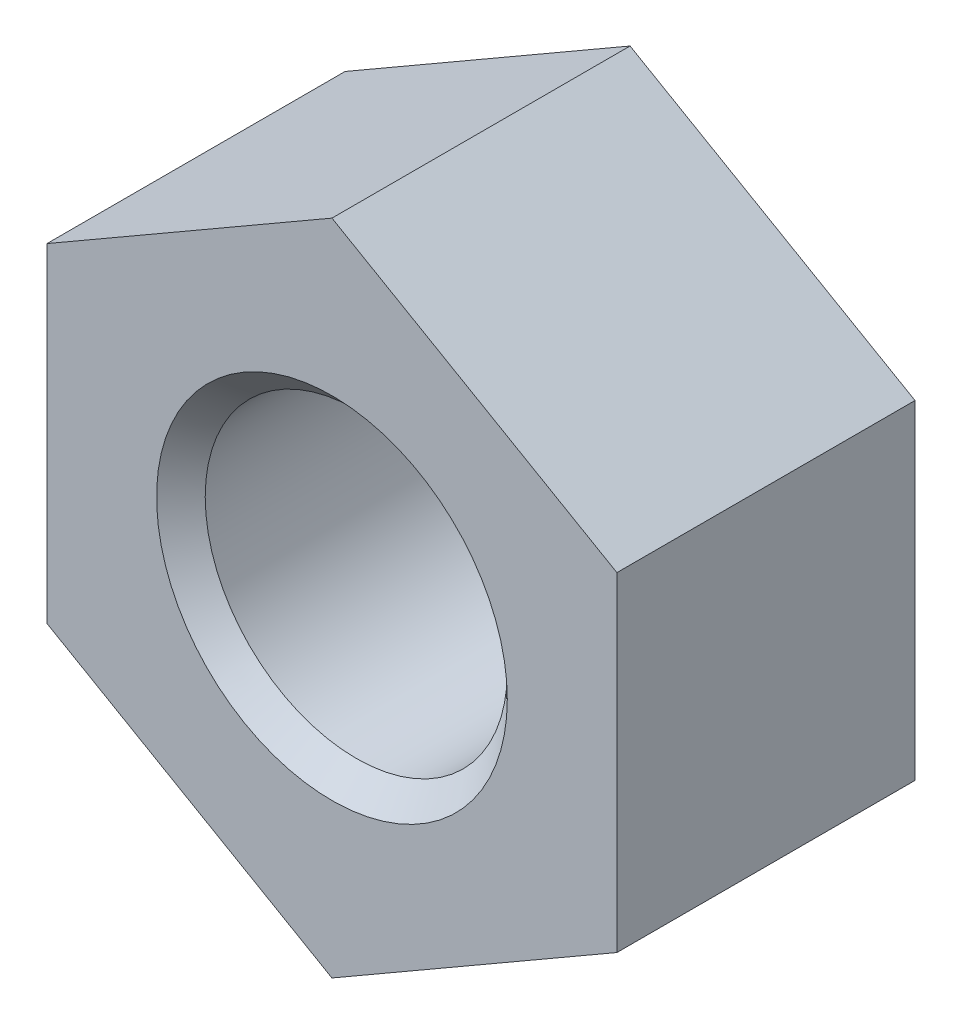
ISO-10303-21;
HEADER;
FILE_DESCRIPTION(('STEP AP214'),'2;1');
FILE_NAME('part.step','',(''),(''),'','','');
FILE_SCHEMA(('AUTOMOTIVE_DESIGN { 1 0 10303 214 1 1 1 1 }'));
ENDSEC;
DATA;
#1=APPLICATION_CONTEXT('core data for automotive mechanical design processes');
#2=APPLICATION_PROTOCOL_DEFINITION('international standard','automotive_design',2000,#1);
#3=PRODUCT_CONTEXT('',#1,'mechanical');
#4=PRODUCT('Part','Part','',(#3));
#5=PRODUCT_RELATED_PRODUCT_CATEGORY('part','',(#4));
#6=PRODUCT_DEFINITION_FORMATION('','',#4);
#7=PRODUCT_DEFINITION_CONTEXT('part definition',#1,'design');
#8=PRODUCT_DEFINITION('design','',#6,#7);
#9=PRODUCT_DEFINITION_SHAPE('','',#8);
#10=(LENGTH_UNIT() NAMED_UNIT(*) SI_UNIT(.MILLI.,.METRE.));
#11=(NAMED_UNIT(*) PLANE_ANGLE_UNIT() SI_UNIT($,.RADIAN.));
#12=(NAMED_UNIT(*) SI_UNIT($,.STERADIAN.) SOLID_ANGLE_UNIT());
#13=UNCERTAINTY_MEASURE_WITH_UNIT(LENGTH_MEASURE(1.E-05),#10,'distance_accuracy_value','');
#14=(GEOMETRIC_REPRESENTATION_CONTEXT(3) GLOBAL_UNCERTAINTY_ASSIGNED_CONTEXT((#13)) GLOBAL_UNIT_ASSIGNED_CONTEXT((#10,
#11,#12)) REPRESENTATION_CONTEXT('',''));
#15=CARTESIAN_POINT('',(0.,0.,0.));
#16=DIRECTION('',(0.,0.,1.));
#17=DIRECTION('',(1.,0.,0.));
#18=AXIS2_PLACEMENT_3D('',#15,#16,#17);
#19=CARTESIAN_POINT('',(0.,0.,6.8));
#20=DIRECTION('',(0.,0.,1.));
#21=DIRECTION('',(1.,0.,0.));
#22=AXIS2_PLACEMENT_3D('',#19,#20,#21);
#23=PLANE('',#22);
#24=CARTESIAN_POINT('',(0.,0.,6.8));
#25=DIRECTION('',(0.,0.,1.));
#26=DIRECTION('',(1.,0.,0.));
#27=AXIS2_PLACEMENT_3D('',#24,#25,#26);
#28=CIRCLE('',#27,4.);
#29=CARTESIAN_POINT('',(4.,0.,6.8));
#30=VERTEX_POINT('',#29);
#31=EDGE_CURVE('E13',#30,#30,#28,.F.);
#32=ORIENTED_EDGE('',*,*,#31,.T.);
#33=EDGE_LOOP('',(#32));
#34=FACE_BOUND('',#33,.T.);
#35=DIRECTION('',(-0.866025403784438,0.5,0.));
#36=VECTOR('',#35,1.);
#37=CARTESIAN_POINT('',(6.49999999999998,3.75277674973258,6.8));
#38=LINE('',#37,#36);
#39=CARTESIAN_POINT('',(6.49999999999998,3.75277674973258,6.8));
#40=VERTEX_POINT('',#39);
#41=CARTESIAN_POINT('',(0.,7.50555349946514,6.8));
#42=VERTEX_POINT('',#41);
#43=EDGE_CURVE('E143',#40,#42,#38,.T.);
#44=ORIENTED_EDGE('',*,*,#43,.T.);
#45=DIRECTION('',(-0.866025403784439,-0.5,0.));
#46=VECTOR('',#45,1.);
#47=CARTESIAN_POINT('',(0.,7.50555349946514,6.8));
#48=LINE('',#47,#46);
#49=CARTESIAN_POINT('',(-6.5,3.75277674973258,6.8));
#50=VERTEX_POINT('',#49);
#51=EDGE_CURVE('E103',#42,#50,#48,.T.);
#52=ORIENTED_EDGE('',*,*,#51,.T.);
#53=DIRECTION('',(0.,-1.,0.));
#54=VECTOR('',#53,1.);
#55=CARTESIAN_POINT('',(-6.5,3.75277674973258,6.8));
#56=LINE('',#55,#54);
#57=CARTESIAN_POINT('',(-6.5,-3.75277674973256,6.8));
#58=VERTEX_POINT('',#57);
#59=EDGE_CURVE('E115',#50,#58,#56,.T.);
#60=ORIENTED_EDGE('',*,*,#59,.T.);
#61=DIRECTION('',(0.866025403784439,-0.5,0.));
#62=VECTOR('',#61,1.);
#63=CARTESIAN_POINT('',(-6.5,-3.75277674973256,6.8));
#64=LINE('',#63,#62);
#65=CARTESIAN_POINT('',(0.,-7.50555349946513,6.8));
#66=VERTEX_POINT('',#65);
#67=EDGE_CURVE('E110',#58,#66,#64,.T.);
#68=ORIENTED_EDGE('',*,*,#67,.T.);
#69=DIRECTION('',(0.866025403784439,0.5,0.));
#70=VECTOR('',#69,1.);
#71=CARTESIAN_POINT('',(0.,-7.50555349946513,6.8));
#72=LINE('',#71,#70);
#73=CARTESIAN_POINT('',(6.49999999999998,-3.75277674973257,6.8));
#74=VERTEX_POINT('',#73);
#75=EDGE_CURVE('E113',#66,#74,#72,.T.);
#76=ORIENTED_EDGE('',*,*,#75,.T.);
#77=DIRECTION('',(0.,1.,0.));
#78=VECTOR('',#77,1.);
#79=CARTESIAN_POINT('',(6.49999999999998,-3.75277674973257,6.8));
#80=LINE('',#79,#78);
#81=EDGE_CURVE('E65',#74,#40,#80,.T.);
#82=ORIENTED_EDGE('',*,*,#81,.T.);
#83=EDGE_LOOP('',(#44,#52,#60,#68,#76,#82));
#84=FACE_BOUND('',#83,.T.);
#85=ADVANCED_FACE('F48',(#34,#84),#23,.T.);
#86=CARTESIAN_POINT('',(0.,0.,0.));
#87=DIRECTION('',(0.,0.,1.));
#88=DIRECTION('',(1.,0.,0.));
#89=AXIS2_PLACEMENT_3D('',#86,#87,#88);
#90=PLANE('',#89);
#91=CARTESIAN_POINT('',(0.,0.,0.));
#92=DIRECTION('',(0.,0.,1.));
#93=DIRECTION('',(1.,0.,0.));
#94=AXIS2_PLACEMENT_3D('',#91,#92,#93);
#95=CIRCLE('',#94,4.);
#96=CARTESIAN_POINT('',(4.,0.,0.));
#97=VERTEX_POINT('',#96);
#98=EDGE_CURVE('E152',#97,#97,#95,.T.);
#99=ORIENTED_EDGE('',*,*,#98,.T.);
#100=EDGE_LOOP('',(#99));
#101=FACE_BOUND('',#100,.T.);
#102=DIRECTION('',(-0.866025403784438,0.5,0.));
#103=VECTOR('',#102,1.);
#104=CARTESIAN_POINT('',(6.49999999999998,3.75277674973258,0.));
#105=LINE('',#104,#103);
#106=CARTESIAN_POINT('',(6.49999999999998,3.75277674973258,0.));
#107=VERTEX_POINT('',#106);
#108=CARTESIAN_POINT('',(0.,7.50555349946514,0.));
#109=VERTEX_POINT('',#108);
#110=EDGE_CURVE('E133',#107,#109,#105,.T.);
#111=ORIENTED_EDGE('',*,*,#110,.F.);
#112=DIRECTION('',(0.,1.,0.));
#113=VECTOR('',#112,1.);
#114=CARTESIAN_POINT('',(6.49999999999998,-3.75277674973257,0.));
#115=LINE('',#114,#113);
#116=CARTESIAN_POINT('',(6.49999999999998,-3.75277674973257,0.));
#117=VERTEX_POINT('',#116);
#118=EDGE_CURVE('E94',#117,#107,#115,.T.);
#119=ORIENTED_EDGE('',*,*,#118,.F.);
#120=DIRECTION('',(0.866025403784439,0.5,0.));
#121=VECTOR('',#120,1.);
#122=CARTESIAN_POINT('',(0.,-7.50555349946513,0.));
#123=LINE('',#122,#121);
#124=CARTESIAN_POINT('',(0.,-7.50555349946513,0.));
#125=VERTEX_POINT('',#124);
#126=EDGE_CURVE('E88',#125,#117,#123,.T.);
#127=ORIENTED_EDGE('',*,*,#126,.F.);
#128=DIRECTION('',(0.866025403784439,-0.5,0.));
#129=VECTOR('',#128,1.);
#130=CARTESIAN_POINT('',(-6.5,-3.75277674973256,0.));
#131=LINE('',#130,#129);
#132=CARTESIAN_POINT('',(-6.5,-3.75277674973256,0.));
#133=VERTEX_POINT('',#132);
#134=EDGE_CURVE('E123',#133,#125,#131,.T.);
#135=ORIENTED_EDGE('',*,*,#134,.F.);
#136=DIRECTION('',(0.,-1.,0.));
#137=VECTOR('',#136,1.);
#138=CARTESIAN_POINT('',(-6.5,3.75277674973258,0.));
#139=LINE('',#138,#137);
#140=CARTESIAN_POINT('',(-6.5,3.75277674973258,0.));
#141=VERTEX_POINT('',#140);
#142=EDGE_CURVE('E138',#141,#133,#139,.T.);
#143=ORIENTED_EDGE('',*,*,#142,.F.);
#144=DIRECTION('',(-0.866025403784439,-0.5,0.));
#145=VECTOR('',#144,1.);
#146=CARTESIAN_POINT('',(0.,7.50555349946514,0.));
#147=LINE('',#146,#145);
#148=EDGE_CURVE('E136',#109,#141,#147,.T.);
#149=ORIENTED_EDGE('',*,*,#148,.F.);
#150=EDGE_LOOP('',(#111,#119,#127,#135,#143,#149));
#151=FACE_BOUND('',#150,.T.);
#152=ADVANCED_FACE('F168',(#101,#151),#90,.F.);
#153=CARTESIAN_POINT('',(6.49999999999998,3.75277674973258,6.8));
#154=DIRECTION('',(-0.5,-0.866025403784438,0.));
#155=DIRECTION('',(0.866025403784439,-0.5,0.));
#156=AXIS2_PLACEMENT_3D('',#153,#154,#155);
#157=PLANE('',#156);
#158=ORIENTED_EDGE('',*,*,#110,.T.);
#159=DIRECTION('',(0.,0.,-1.));
#160=VECTOR('',#159,1.);
#161=CARTESIAN_POINT('',(0.,7.50555349946514,6.8));
#162=LINE('',#161,#160);
#163=EDGE_CURVE('E150',#42,#109,#162,.T.);
#164=ORIENTED_EDGE('',*,*,#163,.F.);
#165=ORIENTED_EDGE('',*,*,#43,.F.);
#166=DIRECTION('',(0.,0.,-1.));
#167=VECTOR('',#166,1.);
#168=CARTESIAN_POINT('',(6.49999999999998,3.75277674973258,6.8));
#169=LINE('',#168,#167);
#170=EDGE_CURVE('E129',#40,#107,#169,.T.);
#171=ORIENTED_EDGE('',*,*,#170,.T.);
#172=EDGE_LOOP('',(#158,#164,#165,#171));
#173=FACE_BOUND('',#172,.T.);
#174=ADVANCED_FACE('F171',(#173),#157,.F.);
#175=CARTESIAN_POINT('',(0.,7.50555349946514,6.8));
#176=DIRECTION('',(0.5,-0.866025403784439,0.));
#177=DIRECTION('',(0.866025403784439,0.5,0.));
#178=AXIS2_PLACEMENT_3D('',#175,#176,#177);
#179=PLANE('',#178);
#180=ORIENTED_EDGE('',*,*,#148,.T.);
#181=DIRECTION('',(0.,0.,-1.));
#182=VECTOR('',#181,1.);
#183=CARTESIAN_POINT('',(-6.5,3.75277674973258,6.8));
#184=LINE('',#183,#182);
#185=EDGE_CURVE('E147',#50,#141,#184,.T.);
#186=ORIENTED_EDGE('',*,*,#185,.F.);
#187=ORIENTED_EDGE('',*,*,#51,.F.);
#188=ORIENTED_EDGE('',*,*,#163,.T.);
#189=EDGE_LOOP('',(#180,#186,#187,#188));
#190=FACE_BOUND('',#189,.T.);
#191=ADVANCED_FACE('F229',(#190),#179,.F.);
#192=CARTESIAN_POINT('',(-6.5,3.75277674973258,6.8));
#193=DIRECTION('',(1.,0.,0.));
#194=DIRECTION('',(0.,1.,0.));
#195=AXIS2_PLACEMENT_3D('',#192,#193,#194);
#196=PLANE('',#195);
#197=ORIENTED_EDGE('',*,*,#142,.T.);
#198=DIRECTION('',(0.,0.,-1.));
#199=VECTOR('',#198,1.);
#200=CARTESIAN_POINT('',(-6.5,-3.75277674973256,6.8));
#201=LINE('',#200,#199);
#202=EDGE_CURVE('E124',#58,#133,#201,.T.);
#203=ORIENTED_EDGE('',*,*,#202,.F.);
#204=ORIENTED_EDGE('',*,*,#59,.F.);
#205=ORIENTED_EDGE('',*,*,#185,.T.);
#206=EDGE_LOOP('',(#197,#203,#204,#205));
#207=FACE_BOUND('',#206,.T.);
#208=ADVANCED_FACE('F222',(#207),#196,.F.);
#209=CARTESIAN_POINT('',(-6.5,-3.75277674973256,6.8));
#210=DIRECTION('',(0.5,0.866025403784439,0.));
#211=DIRECTION('',(-0.866025403784439,0.5,0.));
#212=AXIS2_PLACEMENT_3D('',#209,#210,#211);
#213=PLANE('',#212);
#214=ORIENTED_EDGE('',*,*,#134,.T.);
#215=DIRECTION('',(0.,0.,-1.));
#216=VECTOR('',#215,1.);
#217=CARTESIAN_POINT('',(0.,-7.50555349946513,6.8));
#218=LINE('',#217,#216);
#219=EDGE_CURVE('E120',#66,#125,#218,.T.);
#220=ORIENTED_EDGE('',*,*,#219,.F.);
#221=ORIENTED_EDGE('',*,*,#67,.F.);
#222=ORIENTED_EDGE('',*,*,#202,.T.);
#223=EDGE_LOOP('',(#214,#220,#221,#222));
#224=FACE_BOUND('',#223,.T.);
#225=ADVANCED_FACE('F121',(#224),#213,.F.);
#226=CARTESIAN_POINT('',(0.,-7.50555349946513,6.8));
#227=DIRECTION('',(-0.5,0.866025403784439,0.));
#228=DIRECTION('',(-0.866025403784439,-0.5,0.));
#229=AXIS2_PLACEMENT_3D('',#226,#227,#228);
#230=PLANE('',#229);
#231=ORIENTED_EDGE('',*,*,#126,.T.);
#232=DIRECTION('',(0.,0.,-1.));
#233=VECTOR('',#232,1.);
#234=CARTESIAN_POINT('',(6.49999999999998,-3.75277674973257,6.8));
#235=LINE('',#234,#233);
#236=EDGE_CURVE('E125',#74,#117,#235,.T.);
#237=ORIENTED_EDGE('',*,*,#236,.F.);
#238=ORIENTED_EDGE('',*,*,#75,.F.);
#239=ORIENTED_EDGE('',*,*,#219,.T.);
#240=EDGE_LOOP('',(#231,#237,#238,#239));
#241=FACE_BOUND('',#240,.T.);
#242=ADVANCED_FACE('F127',(#241),#230,.F.);
#243=CARTESIAN_POINT('',(6.49999999999998,-3.75277674973257,6.8));
#244=DIRECTION('',(-1.,0.,0.));
#245=DIRECTION('',(0.,-1.,0.));
#246=AXIS2_PLACEMENT_3D('',#243,#244,#245);
#247=PLANE('',#246);
#248=ORIENTED_EDGE('',*,*,#118,.T.);
#249=ORIENTED_EDGE('',*,*,#170,.F.);
#250=ORIENTED_EDGE('',*,*,#81,.F.);
#251=ORIENTED_EDGE('',*,*,#236,.T.);
#252=EDGE_LOOP('',(#248,#249,#250,#251));
#253=FACE_BOUND('',#252,.T.);
#254=ADVANCED_FACE('F178',(#253),#247,.F.);
#255=CARTESIAN_POINT('',(0.,0.,6.8));
#256=DIRECTION('',(0.,0.,-1.));
#257=DIRECTION('',(-1.,0.,0.));
#258=AXIS2_PLACEMENT_3D('',#255,#256,#257);
#259=CYLINDRICAL_SURFACE('',#258,3.4455);
#260=CARTESIAN_POINT('',(0.,0.,0.554499999999999));
#261=DIRECTION('',(0.,0.,1.));
#262=DIRECTION('',(1.,0.,0.));
#263=AXIS2_PLACEMENT_3D('',#260,#261,#262);
#264=CIRCLE('',#263,3.4455);
#265=CARTESIAN_POINT('',(3.4455,0.,0.554499999999999));
#266=VERTEX_POINT('',#265);
#267=EDGE_CURVE('E57',#266,#266,#264,.F.);
#268=ORIENTED_EDGE('',*,*,#267,.T.);
#269=EDGE_LOOP('',(#268));
#270=FACE_BOUND('',#269,.T.);
#271=CARTESIAN_POINT('',(0.,0.,6.2455));
#272=DIRECTION('',(0.,0.,1.));
#273=DIRECTION('',(1.,0.,0.));
#274=AXIS2_PLACEMENT_3D('',#271,#272,#273);
#275=CIRCLE('',#274,3.4455);
#276=CARTESIAN_POINT('',(3.4455,0.,6.2455));
#277=VERTEX_POINT('',#276);
#278=EDGE_CURVE('E155',#277,#277,#275,.T.);
#279=ORIENTED_EDGE('',*,*,#278,.T.);
#280=EDGE_LOOP('',(#279));
#281=FACE_BOUND('',#280,.T.);
#282=ADVANCED_FACE('F160',(#270,#281),#259,.F.);
#283=CARTESIAN_POINT('',(0.,0.,0.));
#284=DIRECTION('',(0.,0.,-1.));
#285=DIRECTION('',(-1.,0.,0.));
#286=AXIS2_PLACEMENT_3D('',#283,#284,#285);
#287=CONICAL_SURFACE('',#286,4.,0.785398163397446);
#288=ORIENTED_EDGE('',*,*,#267,.F.);
#289=EDGE_LOOP('',(#288));
#290=FACE_BOUND('',#289,.T.);
#291=ORIENTED_EDGE('',*,*,#98,.F.);
#292=EDGE_LOOP('',(#291));
#293=FACE_BOUND('',#292,.T.);
#294=ADVANCED_FACE('F163',(#290,#293),#287,.F.);
#295=CARTESIAN_POINT('',(0.,0.,6.2455));
#296=DIRECTION('',(0.,0.,1.));
#297=DIRECTION('',(1.,0.,0.));
#298=AXIS2_PLACEMENT_3D('',#295,#296,#297);
#299=CONICAL_SURFACE('',#298,3.4455,0.785398163397448);
#300=ORIENTED_EDGE('',*,*,#31,.F.);
#301=EDGE_LOOP('',(#300));
#302=FACE_BOUND('',#301,.T.);
#303=ORIENTED_EDGE('',*,*,#278,.F.);
#304=EDGE_LOOP('',(#303));
#305=FACE_BOUND('',#304,.T.);
#306=ADVANCED_FACE('F50',(#302,#305),#299,.F.);
#307=CLOSED_SHELL('',(#85,#152,#174,#191,#208,#225,#242,#254,#282,#294,#306));
#308=MANIFOLD_SOLID_BREP('B2',#307);
#309=ADVANCED_BREP_SHAPE_REPRESENTATION('',(#18,#308),#14);
#310=SHAPE_DEFINITION_REPRESENTATION(#9,#309);
ENDSEC;
END-ISO-10303-21;
